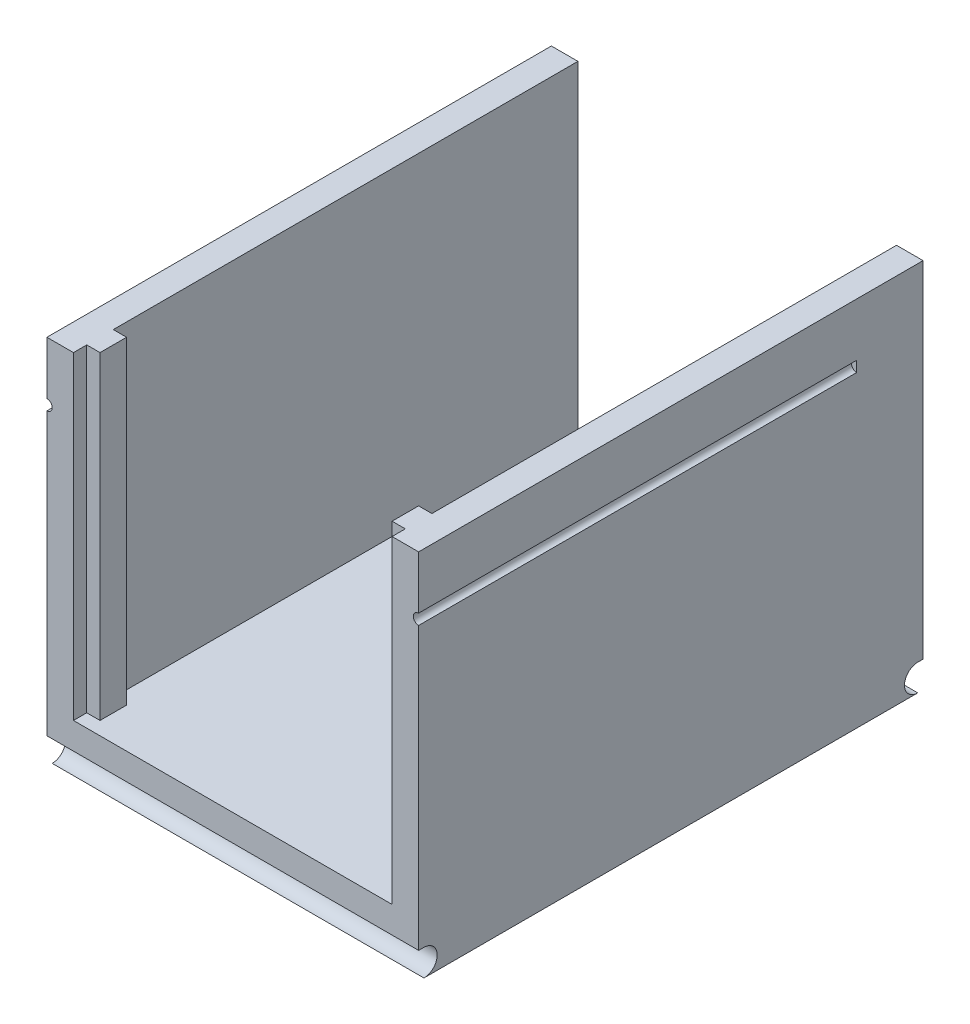
ISO-10303-21;
HEADER;
FILE_DESCRIPTION(('STEP AP214'),'2;1');
FILE_NAME('part.step','',(''),(''),'','','');
FILE_SCHEMA(('AUTOMOTIVE_DESIGN { 1 0 10303 214 1 1 1 1 }'));
ENDSEC;
DATA;
#1=APPLICATION_CONTEXT('core data for automotive mechanical design processes');
#2=APPLICATION_PROTOCOL_DEFINITION('international standard','automotive_design',2000,#1);
#3=PRODUCT_CONTEXT('',#1,'mechanical');
#4=PRODUCT('Part','Part','',(#3));
#5=PRODUCT_RELATED_PRODUCT_CATEGORY('part','',(#4));
#6=PRODUCT_DEFINITION_FORMATION('','',#4);
#7=PRODUCT_DEFINITION_CONTEXT('part definition',#1,'design');
#8=PRODUCT_DEFINITION('design','',#6,#7);
#9=PRODUCT_DEFINITION_SHAPE('','',#8);
#10=(LENGTH_UNIT() NAMED_UNIT(*) SI_UNIT(.MILLI.,.METRE.));
#11=(NAMED_UNIT(*) PLANE_ANGLE_UNIT() SI_UNIT($,.RADIAN.));
#12=(NAMED_UNIT(*) SI_UNIT($,.STERADIAN.) SOLID_ANGLE_UNIT());
#13=UNCERTAINTY_MEASURE_WITH_UNIT(LENGTH_MEASURE(1.E-05),#10,'distance_accuracy_value','');
#14=(GEOMETRIC_REPRESENTATION_CONTEXT(3) GLOBAL_UNCERTAINTY_ASSIGNED_CONTEXT((#13)) GLOBAL_UNIT_ASSIGNED_CONTEXT((#10,
#11,#12)) REPRESENTATION_CONTEXT('',''));
#15=CARTESIAN_POINT('',(0.,0.,0.));
#16=DIRECTION('',(0.,0.,1.));
#17=DIRECTION('',(1.,0.,0.));
#18=AXIS2_PLACEMENT_3D('',#15,#16,#17);
#19=CARTESIAN_POINT('',(-70.,70.,-190.));
#20=DIRECTION('',(-1.,0.,0.));
#21=DIRECTION('',(0.,-1.,0.));
#22=AXIS2_PLACEMENT_3D('',#19,#20,#21);
#23=PLANE('',#22);
#24=DIRECTION('',(0.,-1.,0.));
#25=VECTOR('',#24,1.);
#26=CARTESIAN_POINT('',(-70.,70.,0.));
#27=LINE('',#26,#25);
#28=CARTESIAN_POINT('',(-70.,46.,0.));
#29=VERTEX_POINT('',#28);
#30=CARTESIAN_POINT('',(-70.,-60.,0.));
#31=VERTEX_POINT('',#30);
#32=EDGE_CURVE('E354',#29,#31,#27,.T.);
#33=ORIENTED_EDGE('',*,*,#32,.F.);
#34=DIRECTION('',(0.,0.,1.));
#35=VECTOR('',#34,1.);
#36=CARTESIAN_POINT('',(-70.,46.,-165.));
#37=LINE('',#36,#35);
#38=CARTESIAN_POINT('',(-70.,46.,-165.));
#39=VERTEX_POINT('',#38);
#40=EDGE_CURVE('E42',#39,#29,#37,.T.);
#41=ORIENTED_EDGE('',*,*,#40,.F.);
#42=DIRECTION('',(0.,-1.,0.));
#43=VECTOR('',#42,1.);
#44=CARTESIAN_POINT('',(-70.,0.,-165.));
#45=LINE('',#44,#43);
#46=CARTESIAN_POINT('',(-70.,50.,-165.));
#47=VERTEX_POINT('',#46);
#48=EDGE_CURVE('E189',#47,#39,#45,.T.);
#49=ORIENTED_EDGE('',*,*,#48,.F.);
#50=DIRECTION('',(0.,0.,1.));
#51=VECTOR('',#50,1.);
#52=CARTESIAN_POINT('',(-70.,50.,-165.));
#53=LINE('',#52,#51);
#54=CARTESIAN_POINT('',(-70.,50.,0.));
#55=VERTEX_POINT('',#54);
#56=EDGE_CURVE('E179',#47,#55,#53,.T.);
#57=ORIENTED_EDGE('',*,*,#56,.T.);
#58=CARTESIAN_POINT('',(-70.,70.,0.));
#59=VERTEX_POINT('',#58);
#60=EDGE_CURVE('E340',#59,#55,#27,.T.);
#61=ORIENTED_EDGE('',*,*,#60,.F.);
#62=DIRECTION('',(0.,0.,1.));
#63=VECTOR('',#62,1.);
#64=CARTESIAN_POINT('',(-70.,70.,-190.));
#65=LINE('',#64,#63);
#66=CARTESIAN_POINT('',(-70.,70.,-190.));
#67=VERTEX_POINT('',#66);
#68=EDGE_CURVE('E357',#67,#59,#65,.T.);
#69=ORIENTED_EDGE('',*,*,#68,.F.);
#70=DIRECTION('',(0.,-1.,0.));
#71=VECTOR('',#70,1.);
#72=CARTESIAN_POINT('',(-70.,70.,-190.));
#73=LINE('',#72,#71);
#74=CARTESIAN_POINT('',(-70.,-60.,-190.));
#75=VERTEX_POINT('',#74);
#76=EDGE_CURVE('E344',#67,#75,#73,.T.);
#77=ORIENTED_EDGE('',*,*,#76,.T.);
#78=DIRECTION('',(0.,0.,-1.));
#79=VECTOR('',#78,1.);
#80=CARTESIAN_POINT('',(-70.,-60.,-190.));
#81=LINE('',#80,#79);
#82=CARTESIAN_POINT('',(-70.,-60.,-188.));
#83=VERTEX_POINT('',#82);
#84=EDGE_CURVE('E230',#83,#75,#81,.T.);
#85=ORIENTED_EDGE('',*,*,#84,.F.);
#86=CARTESIAN_POINT('',(-70.,-65.,-188.));
#87=DIRECTION('',(-1.,0.,0.));
#88=DIRECTION('',(0.,-1.,0.));
#89=AXIS2_PLACEMENT_3D('',#86,#87,#88);
#90=CIRCLE('',#89,5.);
#91=CARTESIAN_POINT('',(-70.,-70.,-188.));
#92=VERTEX_POINT('',#91);
#93=EDGE_CURVE('E221',#92,#83,#90,.T.);
#94=ORIENTED_EDGE('',*,*,#93,.F.);
#95=DIRECTION('',(0.,0.,1.));
#96=VECTOR('',#95,1.);
#97=CARTESIAN_POINT('',(-70.,-70.,-190.));
#98=LINE('',#97,#96);
#99=CARTESIAN_POINT('',(-70.,-70.,-2.));
#100=VERTEX_POINT('',#99);
#101=EDGE_CURVE('E26',#92,#100,#98,.T.);
#102=ORIENTED_EDGE('',*,*,#101,.T.);
#103=CARTESIAN_POINT('',(-70.,-65.,-2.));
#104=DIRECTION('',(1.,0.,0.));
#105=DIRECTION('',(0.,-1.,0.));
#106=AXIS2_PLACEMENT_3D('',#103,#104,#105);
#107=CIRCLE('',#106,5.);
#108=CARTESIAN_POINT('',(-70.,-60.,-2.));
#109=VERTEX_POINT('',#108);
#110=EDGE_CURVE('E211',#100,#109,#107,.T.);
#111=ORIENTED_EDGE('',*,*,#110,.T.);
#112=DIRECTION('',(0.,0.,1.));
#113=VECTOR('',#112,1.);
#114=CARTESIAN_POINT('',(-70.,-60.,0.));
#115=LINE('',#114,#113);
#116=EDGE_CURVE('E215',#109,#31,#115,.T.);
#117=ORIENTED_EDGE('',*,*,#116,.T.);
#118=EDGE_LOOP('',(#33,#41,#49,#57,#61,#69,#77,#85,#94,#102,#111,#117));
#119=FACE_BOUND('',#118,.T.);
#120=ADVANCED_FACE('F17',(#119),#23,.T.);
#121=CARTESIAN_POINT('',(0.,0.,0.));
#122=DIRECTION('',(0.,0.,1.));
#123=DIRECTION('',(1.,0.,0.));
#124=AXIS2_PLACEMENT_3D('',#121,#122,#123);
#125=PLANE('',#124);
#126=ORIENTED_EDGE('',*,*,#60,.T.);
#127=CARTESIAN_POINT('',(-70.,48.,0.));
#128=DIRECTION('',(0.,0.,1.));
#129=DIRECTION('',(1.,0.,0.));
#130=AXIS2_PLACEMENT_3D('',#127,#128,#129);
#131=CIRCLE('',#130,2.);
#132=EDGE_CURVE('E184',#55,#29,#131,.F.);
#133=ORIENTED_EDGE('',*,*,#132,.T.);
#134=ORIENTED_EDGE('',*,*,#32,.T.);
#135=DIRECTION('',(-1.,0.,0.));
#136=VECTOR('',#135,1.);
#137=CARTESIAN_POINT('',(82.2065556157337,-60.,0.));
#138=LINE('',#137,#136);
#139=CARTESIAN_POINT('',(70.,-60.,0.));
#140=VERTEX_POINT('',#139);
#141=EDGE_CURVE('E218',#140,#31,#138,.T.);
#142=ORIENTED_EDGE('',*,*,#141,.F.);
#143=DIRECTION('',(0.,1.,0.));
#144=VECTOR('',#143,1.);
#145=CARTESIAN_POINT('',(70.,70.,0.));
#146=LINE('',#145,#144);
#147=CARTESIAN_POINT('',(70.,46.,0.));
#148=VERTEX_POINT('',#147);
#149=EDGE_CURVE('E347',#140,#148,#146,.T.);
#150=ORIENTED_EDGE('',*,*,#149,.T.);
#151=CARTESIAN_POINT('',(70.,48.,0.));
#152=DIRECTION('',(0.,0.,1.));
#153=DIRECTION('',(1.,0.,0.));
#154=AXIS2_PLACEMENT_3D('',#151,#152,#153);
#155=CIRCLE('',#154,2.);
#156=CARTESIAN_POINT('',(70.,50.,0.));
#157=VERTEX_POINT('',#156);
#158=EDGE_CURVE('E204',#157,#148,#155,.T.);
#159=ORIENTED_EDGE('',*,*,#158,.F.);
#160=CARTESIAN_POINT('',(70.,70.,0.));
#161=VERTEX_POINT('',#160);
#162=EDGE_CURVE('E314',#157,#161,#146,.T.);
#163=ORIENTED_EDGE('',*,*,#162,.T.);
#164=DIRECTION('',(-1.,0.,0.));
#165=VECTOR('',#164,1.);
#166=CARTESIAN_POINT('',(-70.,70.,0.));
#167=LINE('',#166,#165);
#168=CARTESIAN_POINT('',(60.,70.,0.));
#169=VERTEX_POINT('',#168);
#170=EDGE_CURVE('E351',#161,#169,#167,.T.);
#171=ORIENTED_EDGE('',*,*,#170,.T.);
#172=DIRECTION('',(0.,1.,0.));
#173=VECTOR('',#172,1.);
#174=CARTESIAN_POINT('',(60.,-50.,0.));
#175=LINE('',#174,#173);
#176=CARTESIAN_POINT('',(60.,-50.,0.));
#177=VERTEX_POINT('',#176);
#178=EDGE_CURVE('E284',#177,#169,#175,.T.);
#179=ORIENTED_EDGE('',*,*,#178,.F.);
#180=DIRECTION('',(1.,0.,0.));
#181=VECTOR('',#180,1.);
#182=CARTESIAN_POINT('',(-60.,-50.,0.));
#183=LINE('',#182,#181);
#184=CARTESIAN_POINT('',(-60.,-50.,0.));
#185=VERTEX_POINT('',#184);
#186=EDGE_CURVE('E248',#185,#177,#183,.T.);
#187=ORIENTED_EDGE('',*,*,#186,.F.);
#188=DIRECTION('',(0.,1.,0.));
#189=VECTOR('',#188,1.);
#190=CARTESIAN_POINT('',(-60.,-50.,0.));
#191=LINE('',#190,#189);
#192=CARTESIAN_POINT('',(-60.,70.,0.));
#193=VERTEX_POINT('',#192);
#194=EDGE_CURVE('E311',#185,#193,#191,.T.);
#195=ORIENTED_EDGE('',*,*,#194,.T.);
#196=EDGE_CURVE('E350',#193,#59,#167,.T.);
#197=ORIENTED_EDGE('',*,*,#196,.T.);
#198=EDGE_LOOP('',(#126,#133,#134,#142,#150,#159,#163,#171,#179,#187,#195,#197));
#199=FACE_BOUND('',#198,.T.);
#200=ADVANCED_FACE('F376',(#199),#125,.T.);
#201=CARTESIAN_POINT('',(70.,70.,-190.));
#202=DIRECTION('',(1.,0.,0.));
#203=DIRECTION('',(0.,1.,0.));
#204=AXIS2_PLACEMENT_3D('',#201,#202,#203);
#205=PLANE('',#204);
#206=DIRECTION('',(0.,0.,1.));
#207=VECTOR('',#206,1.);
#208=CARTESIAN_POINT('',(70.,50.,-165.));
#209=LINE('',#208,#207);
#210=CARTESIAN_POINT('',(70.,50.,-165.));
#211=VERTEX_POINT('',#210);
#212=EDGE_CURVE('E34',#211,#157,#209,.T.);
#213=ORIENTED_EDGE('',*,*,#212,.F.);
#214=DIRECTION('',(0.,1.,0.));
#215=VECTOR('',#214,1.);
#216=CARTESIAN_POINT('',(70.,0.,-165.));
#217=LINE('',#216,#215);
#218=CARTESIAN_POINT('',(70.,46.,-165.));
#219=VERTEX_POINT('',#218);
#220=EDGE_CURVE('E201',#219,#211,#217,.T.);
#221=ORIENTED_EDGE('',*,*,#220,.F.);
#222=DIRECTION('',(0.,0.,1.));
#223=VECTOR('',#222,1.);
#224=CARTESIAN_POINT('',(70.,46.,-165.));
#225=LINE('',#224,#223);
#226=EDGE_CURVE('E198',#219,#148,#225,.T.);
#227=ORIENTED_EDGE('',*,*,#226,.T.);
#228=ORIENTED_EDGE('',*,*,#149,.F.);
#229=DIRECTION('',(0.,0.,1.));
#230=VECTOR('',#229,1.);
#231=CARTESIAN_POINT('',(70.,-60.,0.));
#232=LINE('',#231,#230);
#233=CARTESIAN_POINT('',(70.,-60.,-2.));
#234=VERTEX_POINT('',#233);
#235=EDGE_CURVE('E219',#234,#140,#232,.T.);
#236=ORIENTED_EDGE('',*,*,#235,.F.);
#237=CARTESIAN_POINT('',(70.,-65.,-2.));
#238=DIRECTION('',(1.,0.,0.));
#239=DIRECTION('',(0.,1.,0.));
#240=AXIS2_PLACEMENT_3D('',#237,#238,#239);
#241=CIRCLE('',#240,5.);
#242=CARTESIAN_POINT('',(70.,-70.,-2.));
#243=VERTEX_POINT('',#242);
#244=EDGE_CURVE('E222',#243,#234,#241,.T.);
#245=ORIENTED_EDGE('',*,*,#244,.F.);
#246=DIRECTION('',(0.,0.,1.));
#247=VECTOR('',#246,1.);
#248=CARTESIAN_POINT('',(70.,-70.,-190.));
#249=LINE('',#248,#247);
#250=CARTESIAN_POINT('',(70.,-70.,-188.));
#251=VERTEX_POINT('',#250);
#252=EDGE_CURVE('E11',#251,#243,#249,.T.);
#253=ORIENTED_EDGE('',*,*,#252,.F.);
#254=CARTESIAN_POINT('',(70.,-65.,-188.));
#255=DIRECTION('',(1.,0.,0.));
#256=DIRECTION('',(0.,1.,0.));
#257=AXIS2_PLACEMENT_3D('',#254,#255,#256);
#258=CIRCLE('',#257,5.);
#259=CARTESIAN_POINT('',(70.,-60.,-188.));
#260=VERTEX_POINT('',#259);
#261=EDGE_CURVE('E232',#251,#260,#258,.F.);
#262=ORIENTED_EDGE('',*,*,#261,.T.);
#263=DIRECTION('',(0.,0.,-1.));
#264=VECTOR('',#263,1.);
#265=CARTESIAN_POINT('',(70.,-60.,-190.));
#266=LINE('',#265,#264);
#267=CARTESIAN_POINT('',(70.,-60.,-190.));
#268=VERTEX_POINT('',#267);
#269=EDGE_CURVE('E238',#260,#268,#266,.T.);
#270=ORIENTED_EDGE('',*,*,#269,.T.);
#271=DIRECTION('',(0.,1.,0.));
#272=VECTOR('',#271,1.);
#273=CARTESIAN_POINT('',(70.,70.,-190.));
#274=LINE('',#273,#272);
#275=CARTESIAN_POINT('',(70.,70.,-190.));
#276=VERTEX_POINT('',#275);
#277=EDGE_CURVE('E337',#268,#276,#274,.T.);
#278=ORIENTED_EDGE('',*,*,#277,.T.);
#279=DIRECTION('',(0.,0.,1.));
#280=VECTOR('',#279,1.);
#281=CARTESIAN_POINT('',(70.,70.,-190.));
#282=LINE('',#281,#280);
#283=EDGE_CURVE('E21',#276,#161,#282,.T.);
#284=ORIENTED_EDGE('',*,*,#283,.T.);
#285=ORIENTED_EDGE('',*,*,#162,.F.);
#286=EDGE_LOOP('',(#213,#221,#227,#228,#236,#245,#253,#262,#270,#278,#284,#285));
#287=FACE_BOUND('',#286,.T.);
#288=ADVANCED_FACE('F19',(#287),#205,.T.);
#289=CARTESIAN_POINT('',(-70.,70.,-190.));
#290=DIRECTION('',(0.,1.,0.));
#291=DIRECTION('',(0.,0.,1.));
#292=AXIS2_PLACEMENT_3D('',#289,#290,#291);
#293=PLANE('',#292);
#294=DIRECTION('',(0.,0.,1.));
#295=VECTOR('',#294,1.);
#296=CARTESIAN_POINT('',(-60.,70.,-5.));
#297=LINE('',#296,#295);
#298=CARTESIAN_POINT('',(-60.,70.,-5.));
#299=VERTEX_POINT('',#298);
#300=EDGE_CURVE('E252',#299,#193,#297,.T.);
#301=ORIENTED_EDGE('',*,*,#300,.F.);
#302=DIRECTION('',(-1.,0.,0.));
#303=VECTOR('',#302,1.);
#304=CARTESIAN_POINT('',(-55.,70.,-5.));
#305=LINE('',#304,#303);
#306=CARTESIAN_POINT('',(-55.,70.,-5.));
#307=VERTEX_POINT('',#306);
#308=EDGE_CURVE('E307',#307,#299,#305,.T.);
#309=ORIENTED_EDGE('',*,*,#308,.F.);
#310=DIRECTION('',(0.,0.,1.));
#311=VECTOR('',#310,1.);
#312=CARTESIAN_POINT('',(-55.,70.,-15.));
#313=LINE('',#312,#311);
#314=CARTESIAN_POINT('',(-55.,70.,-15.));
#315=VERTEX_POINT('',#314);
#316=EDGE_CURVE('E304',#315,#307,#313,.T.);
#317=ORIENTED_EDGE('',*,*,#316,.F.);
#318=DIRECTION('',(1.,0.,0.));
#319=VECTOR('',#318,1.);
#320=CARTESIAN_POINT('',(-60.,70.,-15.));
#321=LINE('',#320,#319);
#322=CARTESIAN_POINT('',(-60.,70.,-15.));
#323=VERTEX_POINT('',#322);
#324=EDGE_CURVE('E301',#323,#315,#321,.T.);
#325=ORIENTED_EDGE('',*,*,#324,.F.);
#326=DIRECTION('',(0.,0.,1.));
#327=VECTOR('',#326,1.);
#328=CARTESIAN_POINT('',(-60.,70.,-190.));
#329=LINE('',#328,#327);
#330=CARTESIAN_POINT('',(-60.,70.,-190.));
#331=VERTEX_POINT('',#330);
#332=EDGE_CURVE('E298',#331,#323,#329,.T.);
#333=ORIENTED_EDGE('',*,*,#332,.F.);
#334=DIRECTION('',(-1.,0.,0.));
#335=VECTOR('',#334,1.);
#336=CARTESIAN_POINT('',(-70.,70.,-190.));
#337=LINE('',#336,#335);
#338=EDGE_CURVE('E339',#331,#67,#337,.T.);
#339=ORIENTED_EDGE('',*,*,#338,.T.);
#340=ORIENTED_EDGE('',*,*,#68,.T.);
#341=ORIENTED_EDGE('',*,*,#196,.F.);
#342=EDGE_LOOP('',(#301,#309,#317,#325,#333,#339,#340,#341));
#343=FACE_BOUND('',#342,.T.);
#344=ADVANCED_FACE('F407',(#343),#293,.T.);
#345=CARTESIAN_POINT('',(-70.,-70.,-190.));
#346=DIRECTION('',(0.,-1.,0.));
#347=DIRECTION('',(0.,0.,-1.));
#348=AXIS2_PLACEMENT_3D('',#345,#346,#347);
#349=PLANE('',#348);
#350=DIRECTION('',(-1.,0.,0.));
#351=VECTOR('',#350,1.);
#352=CARTESIAN_POINT('',(82.2065556157337,-70.,-2.));
#353=LINE('',#352,#351);
#354=EDGE_CURVE('E199',#243,#100,#353,.T.);
#355=ORIENTED_EDGE('',*,*,#354,.T.);
#356=ORIENTED_EDGE('',*,*,#101,.F.);
#357=DIRECTION('',(-1.,0.,0.));
#358=VECTOR('',#357,1.);
#359=CARTESIAN_POINT('',(82.2065556157337,-70.,-188.));
#360=LINE('',#359,#358);
#361=EDGE_CURVE('E244',#251,#92,#360,.T.);
#362=ORIENTED_EDGE('',*,*,#361,.F.);
#363=ORIENTED_EDGE('',*,*,#252,.T.);
#364=EDGE_LOOP('',(#355,#356,#362,#363));
#365=FACE_BOUND('',#364,.T.);
#366=ADVANCED_FACE('F404',(#365),#349,.T.);
#367=DIRECTION('',(0.,0.,-1.));
#368=VECTOR('',#367,1.);
#369=CARTESIAN_POINT('',(60.,70.,-15.));
#370=LINE('',#369,#368);
#371=CARTESIAN_POINT('',(60.,70.,-15.));
#372=VERTEX_POINT('',#371);
#373=CARTESIAN_POINT('',(60.,70.,-190.));
#374=VERTEX_POINT('',#373);
#375=EDGE_CURVE('E296',#372,#374,#370,.T.);
#376=ORIENTED_EDGE('',*,*,#375,.F.);
#377=DIRECTION('',(1.,0.,0.));
#378=VECTOR('',#377,1.);
#379=CARTESIAN_POINT('',(55.,70.,-15.));
#380=LINE('',#379,#378);
#381=CARTESIAN_POINT('',(55.,70.,-15.));
#382=VERTEX_POINT('',#381);
#383=EDGE_CURVE('E293',#382,#372,#380,.T.);
#384=ORIENTED_EDGE('',*,*,#383,.F.);
#385=DIRECTION('',(0.,0.,-1.));
#386=VECTOR('',#385,1.);
#387=CARTESIAN_POINT('',(55.,70.,-5.));
#388=LINE('',#387,#386);
#389=CARTESIAN_POINT('',(55.,70.,-5.));
#390=VERTEX_POINT('',#389);
#391=EDGE_CURVE('E290',#390,#382,#388,.T.);
#392=ORIENTED_EDGE('',*,*,#391,.F.);
#393=DIRECTION('',(-1.,0.,0.));
#394=VECTOR('',#393,1.);
#395=CARTESIAN_POINT('',(60.,70.,-5.));
#396=LINE('',#395,#394);
#397=CARTESIAN_POINT('',(60.,70.,-5.));
#398=VERTEX_POINT('',#397);
#399=EDGE_CURVE('E287',#398,#390,#396,.T.);
#400=ORIENTED_EDGE('',*,*,#399,.F.);
#401=DIRECTION('',(0.,0.,-1.));
#402=VECTOR('',#401,1.);
#403=CARTESIAN_POINT('',(60.,70.,0.));
#404=LINE('',#403,#402);
#405=EDGE_CURVE('E247',#169,#398,#404,.T.);
#406=ORIENTED_EDGE('',*,*,#405,.F.);
#407=ORIENTED_EDGE('',*,*,#170,.F.);
#408=ORIENTED_EDGE('',*,*,#283,.F.);
#409=EDGE_CURVE('E341',#276,#374,#337,.T.);
#410=ORIENTED_EDGE('',*,*,#409,.T.);
#411=EDGE_LOOP('',(#376,#384,#392,#400,#406,#407,#408,#410));
#412=FACE_BOUND('',#411,.T.);
#413=ADVANCED_FACE('F372',(#412),#293,.T.);
#414=CARTESIAN_POINT('',(0.,0.,-190.));
#415=DIRECTION('',(0.,0.,1.));
#416=DIRECTION('',(1.,0.,0.));
#417=AXIS2_PLACEMENT_3D('',#414,#415,#416);
#418=PLANE('',#417);
#419=ORIENTED_EDGE('',*,*,#277,.F.);
#420=DIRECTION('',(-1.,0.,0.));
#421=VECTOR('',#420,1.);
#422=CARTESIAN_POINT('',(82.2065556157337,-60.,-190.));
#423=LINE('',#422,#421);
#424=EDGE_CURVE('E241',#268,#75,#423,.T.);
#425=ORIENTED_EDGE('',*,*,#424,.T.);
#426=ORIENTED_EDGE('',*,*,#76,.F.);
#427=ORIENTED_EDGE('',*,*,#338,.F.);
#428=DIRECTION('',(0.,1.,0.));
#429=VECTOR('',#428,1.);
#430=CARTESIAN_POINT('',(-60.,-50.,-190.));
#431=LINE('',#430,#429);
#432=CARTESIAN_POINT('',(-60.,-50.,-190.));
#433=VERTEX_POINT('',#432);
#434=EDGE_CURVE('E323',#433,#331,#431,.T.);
#435=ORIENTED_EDGE('',*,*,#434,.F.);
#436=DIRECTION('',(-1.,0.,0.));
#437=VECTOR('',#436,1.);
#438=CARTESIAN_POINT('',(60.,-50.,-190.));
#439=LINE('',#438,#437);
#440=CARTESIAN_POINT('',(60.,-50.,-190.));
#441=VERTEX_POINT('',#440);
#442=EDGE_CURVE('E267',#441,#433,#439,.T.);
#443=ORIENTED_EDGE('',*,*,#442,.F.);
#444=DIRECTION('',(0.,1.,0.));
#445=VECTOR('',#444,1.);
#446=CARTESIAN_POINT('',(60.,-50.,-190.));
#447=LINE('',#446,#445);
#448=EDGE_CURVE('E325',#441,#374,#447,.T.);
#449=ORIENTED_EDGE('',*,*,#448,.T.);
#450=ORIENTED_EDGE('',*,*,#409,.F.);
#451=EDGE_LOOP('',(#419,#425,#426,#427,#435,#443,#449,#450));
#452=FACE_BOUND('',#451,.T.);
#453=ADVANCED_FACE('F406',(#452),#418,.F.);
#454=CARTESIAN_POINT('',(-60.,-50.,-5.));
#455=DIRECTION('',(-1.,0.,0.));
#456=DIRECTION('',(0.,0.,1.));
#457=AXIS2_PLACEMENT_3D('',#454,#455,#456);
#458=PLANE('',#457);
#459=ORIENTED_EDGE('',*,*,#300,.T.);
#460=ORIENTED_EDGE('',*,*,#194,.F.);
#461=DIRECTION('',(0.,0.,1.));
#462=VECTOR('',#461,1.);
#463=CARTESIAN_POINT('',(-60.,-50.,-5.));
#464=LINE('',#463,#462);
#465=CARTESIAN_POINT('',(-60.,-50.,-5.));
#466=VERTEX_POINT('',#465);
#467=EDGE_CURVE('E282',#466,#185,#464,.T.);
#468=ORIENTED_EDGE('',*,*,#467,.F.);
#469=DIRECTION('',(0.,1.,0.));
#470=VECTOR('',#469,1.);
#471=CARTESIAN_POINT('',(-60.,-50.,-5.));
#472=LINE('',#471,#470);
#473=EDGE_CURVE('E315',#466,#299,#472,.T.);
#474=ORIENTED_EDGE('',*,*,#473,.T.);
#475=EDGE_LOOP('',(#459,#460,#468,#474));
#476=FACE_BOUND('',#475,.T.);
#477=ADVANCED_FACE('F413',(#476),#458,.F.);
#478=CARTESIAN_POINT('',(-55.,-50.,-5.));
#479=DIRECTION('',(0.,0.,-1.));
#480=DIRECTION('',(-1.,0.,0.));
#481=AXIS2_PLACEMENT_3D('',#478,#479,#480);
#482=PLANE('',#481);
#483=ORIENTED_EDGE('',*,*,#308,.T.);
#484=ORIENTED_EDGE('',*,*,#473,.F.);
#485=DIRECTION('',(-1.,0.,0.));
#486=VECTOR('',#485,1.);
#487=CARTESIAN_POINT('',(-55.,-50.,-5.));
#488=LINE('',#487,#486);
#489=CARTESIAN_POINT('',(-55.,-50.,-5.));
#490=VERTEX_POINT('',#489);
#491=EDGE_CURVE('E279',#490,#466,#488,.T.);
#492=ORIENTED_EDGE('',*,*,#491,.F.);
#493=DIRECTION('',(0.,1.,0.));
#494=VECTOR('',#493,1.);
#495=CARTESIAN_POINT('',(-55.,-50.,-5.));
#496=LINE('',#495,#494);
#497=EDGE_CURVE('E317',#490,#307,#496,.T.);
#498=ORIENTED_EDGE('',*,*,#497,.T.);
#499=EDGE_LOOP('',(#483,#484,#492,#498));
#500=FACE_BOUND('',#499,.T.);
#501=ADVANCED_FACE('F433',(#500),#482,.F.);
#502=CARTESIAN_POINT('',(-55.,-50.,-15.));
#503=DIRECTION('',(-1.,0.,0.));
#504=DIRECTION('',(0.,0.,1.));
#505=AXIS2_PLACEMENT_3D('',#502,#503,#504);
#506=PLANE('',#505);
#507=ORIENTED_EDGE('',*,*,#316,.T.);
#508=ORIENTED_EDGE('',*,*,#497,.F.);
#509=DIRECTION('',(0.,0.,1.));
#510=VECTOR('',#509,1.);
#511=CARTESIAN_POINT('',(-55.,-50.,-15.));
#512=LINE('',#511,#510);
#513=CARTESIAN_POINT('',(-55.,-50.,-15.));
#514=VERTEX_POINT('',#513);
#515=EDGE_CURVE('E276',#514,#490,#512,.T.);
#516=ORIENTED_EDGE('',*,*,#515,.F.);
#517=DIRECTION('',(0.,1.,0.));
#518=VECTOR('',#517,1.);
#519=CARTESIAN_POINT('',(-55.,-50.,-15.));
#520=LINE('',#519,#518);
#521=EDGE_CURVE('E319',#514,#315,#520,.T.);
#522=ORIENTED_EDGE('',*,*,#521,.T.);
#523=EDGE_LOOP('',(#507,#508,#516,#522));
#524=FACE_BOUND('',#523,.T.);
#525=ADVANCED_FACE('F435',(#524),#506,.F.);
#526=CARTESIAN_POINT('',(-60.,-50.,-15.));
#527=DIRECTION('',(0.,0.,1.));
#528=DIRECTION('',(1.,0.,0.));
#529=AXIS2_PLACEMENT_3D('',#526,#527,#528);
#530=PLANE('',#529);
#531=ORIENTED_EDGE('',*,*,#324,.T.);
#532=ORIENTED_EDGE('',*,*,#521,.F.);
#533=DIRECTION('',(1.,0.,0.));
#534=VECTOR('',#533,1.);
#535=CARTESIAN_POINT('',(-60.,-50.,-15.));
#536=LINE('',#535,#534);
#537=CARTESIAN_POINT('',(-60.,-50.,-15.));
#538=VERTEX_POINT('',#537);
#539=EDGE_CURVE('E273',#538,#514,#536,.T.);
#540=ORIENTED_EDGE('',*,*,#539,.F.);
#541=DIRECTION('',(0.,1.,0.));
#542=VECTOR('',#541,1.);
#543=CARTESIAN_POINT('',(-60.,-50.,-15.));
#544=LINE('',#543,#542);
#545=EDGE_CURVE('E321',#538,#323,#544,.T.);
#546=ORIENTED_EDGE('',*,*,#545,.T.);
#547=EDGE_LOOP('',(#531,#532,#540,#546));
#548=FACE_BOUND('',#547,.T.);
#549=ADVANCED_FACE('F440',(#548),#530,.F.);
#550=CARTESIAN_POINT('',(-60.,-50.,-190.));
#551=DIRECTION('',(-1.,0.,0.));
#552=DIRECTION('',(0.,0.,1.));
#553=AXIS2_PLACEMENT_3D('',#550,#551,#552);
#554=PLANE('',#553);
#555=ORIENTED_EDGE('',*,*,#332,.T.);
#556=ORIENTED_EDGE('',*,*,#545,.F.);
#557=DIRECTION('',(0.,0.,1.));
#558=VECTOR('',#557,1.);
#559=CARTESIAN_POINT('',(-60.,-50.,-190.));
#560=LINE('',#559,#558);
#561=EDGE_CURVE('E270',#433,#538,#560,.T.);
#562=ORIENTED_EDGE('',*,*,#561,.F.);
#563=ORIENTED_EDGE('',*,*,#434,.T.);
#564=EDGE_LOOP('',(#555,#556,#562,#563));
#565=FACE_BOUND('',#564,.T.);
#566=ADVANCED_FACE('F443',(#565),#554,.F.);
#567=CARTESIAN_POINT('',(60.,-50.,-15.));
#568=DIRECTION('',(1.,0.,0.));
#569=DIRECTION('',(0.,0.,-1.));
#570=AXIS2_PLACEMENT_3D('',#567,#568,#569);
#571=PLANE('',#570);
#572=ORIENTED_EDGE('',*,*,#375,.T.);
#573=ORIENTED_EDGE('',*,*,#448,.F.);
#574=DIRECTION('',(0.,0.,-1.));
#575=VECTOR('',#574,1.);
#576=CARTESIAN_POINT('',(60.,-50.,-15.));
#577=LINE('',#576,#575);
#578=CARTESIAN_POINT('',(60.,-50.,-15.));
#579=VERTEX_POINT('',#578);
#580=EDGE_CURVE('E264',#579,#441,#577,.T.);
#581=ORIENTED_EDGE('',*,*,#580,.F.);
#582=DIRECTION('',(0.,1.,0.));
#583=VECTOR('',#582,1.);
#584=CARTESIAN_POINT('',(60.,-50.,-15.));
#585=LINE('',#584,#583);
#586=EDGE_CURVE('E328',#579,#372,#585,.T.);
#587=ORIENTED_EDGE('',*,*,#586,.T.);
#588=EDGE_LOOP('',(#572,#573,#581,#587));
#589=FACE_BOUND('',#588,.T.);
#590=ADVANCED_FACE('F464',(#589),#571,.F.);
#591=CARTESIAN_POINT('',(55.,-50.,-15.));
#592=DIRECTION('',(0.,0.,1.));
#593=DIRECTION('',(1.,0.,0.));
#594=AXIS2_PLACEMENT_3D('',#591,#592,#593);
#595=PLANE('',#594);
#596=ORIENTED_EDGE('',*,*,#383,.T.);
#597=ORIENTED_EDGE('',*,*,#586,.F.);
#598=DIRECTION('',(1.,0.,0.));
#599=VECTOR('',#598,1.);
#600=CARTESIAN_POINT('',(55.,-50.,-15.));
#601=LINE('',#600,#599);
#602=CARTESIAN_POINT('',(55.,-50.,-15.));
#603=VERTEX_POINT('',#602);
#604=EDGE_CURVE('E261',#603,#579,#601,.T.);
#605=ORIENTED_EDGE('',*,*,#604,.F.);
#606=DIRECTION('',(0.,1.,0.));
#607=VECTOR('',#606,1.);
#608=CARTESIAN_POINT('',(55.,-50.,-15.));
#609=LINE('',#608,#607);
#610=EDGE_CURVE('E330',#603,#382,#609,.T.);
#611=ORIENTED_EDGE('',*,*,#610,.T.);
#612=EDGE_LOOP('',(#596,#597,#605,#611));
#613=FACE_BOUND('',#612,.T.);
#614=ADVANCED_FACE('F468',(#613),#595,.F.);
#615=CARTESIAN_POINT('',(55.,-50.,-5.));
#616=DIRECTION('',(1.,0.,0.));
#617=DIRECTION('',(0.,0.,-1.));
#618=AXIS2_PLACEMENT_3D('',#615,#616,#617);
#619=PLANE('',#618);
#620=ORIENTED_EDGE('',*,*,#391,.T.);
#621=ORIENTED_EDGE('',*,*,#610,.F.);
#622=DIRECTION('',(0.,0.,-1.));
#623=VECTOR('',#622,1.);
#624=CARTESIAN_POINT('',(55.,-50.,-5.));
#625=LINE('',#624,#623);
#626=CARTESIAN_POINT('',(55.,-50.,-5.));
#627=VERTEX_POINT('',#626);
#628=EDGE_CURVE('E258',#627,#603,#625,.T.);
#629=ORIENTED_EDGE('',*,*,#628,.F.);
#630=DIRECTION('',(0.,1.,0.));
#631=VECTOR('',#630,1.);
#632=CARTESIAN_POINT('',(55.,-50.,-5.));
#633=LINE('',#632,#631);
#634=EDGE_CURVE('E332',#627,#390,#633,.T.);
#635=ORIENTED_EDGE('',*,*,#634,.T.);
#636=EDGE_LOOP('',(#620,#621,#629,#635));
#637=FACE_BOUND('',#636,.T.);
#638=ADVANCED_FACE('F471',(#637),#619,.F.);
#639=CARTESIAN_POINT('',(60.,-50.,-5.));
#640=DIRECTION('',(0.,0.,-1.));
#641=DIRECTION('',(-1.,0.,0.));
#642=AXIS2_PLACEMENT_3D('',#639,#640,#641);
#643=PLANE('',#642);
#644=ORIENTED_EDGE('',*,*,#399,.T.);
#645=ORIENTED_EDGE('',*,*,#634,.F.);
#646=DIRECTION('',(-1.,0.,0.));
#647=VECTOR('',#646,1.);
#648=CARTESIAN_POINT('',(60.,-50.,-5.));
#649=LINE('',#648,#647);
#650=CARTESIAN_POINT('',(60.,-50.,-5.));
#651=VERTEX_POINT('',#650);
#652=EDGE_CURVE('E255',#651,#627,#649,.T.);
#653=ORIENTED_EDGE('',*,*,#652,.F.);
#654=DIRECTION('',(0.,1.,0.));
#655=VECTOR('',#654,1.);
#656=CARTESIAN_POINT('',(60.,-50.,-5.));
#657=LINE('',#656,#655);
#658=EDGE_CURVE('E334',#651,#398,#657,.T.);
#659=ORIENTED_EDGE('',*,*,#658,.T.);
#660=EDGE_LOOP('',(#644,#645,#653,#659));
#661=FACE_BOUND('',#660,.T.);
#662=ADVANCED_FACE('F473',(#661),#643,.F.);
#663=CARTESIAN_POINT('',(60.,-50.,0.));
#664=DIRECTION('',(1.,0.,0.));
#665=DIRECTION('',(0.,0.,-1.));
#666=AXIS2_PLACEMENT_3D('',#663,#664,#665);
#667=PLANE('',#666);
#668=ORIENTED_EDGE('',*,*,#405,.T.);
#669=ORIENTED_EDGE('',*,*,#658,.F.);
#670=DIRECTION('',(0.,0.,-1.));
#671=VECTOR('',#670,1.);
#672=CARTESIAN_POINT('',(60.,-50.,0.));
#673=LINE('',#672,#671);
#674=EDGE_CURVE('E251',#177,#651,#673,.T.);
#675=ORIENTED_EDGE('',*,*,#674,.F.);
#676=ORIENTED_EDGE('',*,*,#178,.T.);
#677=EDGE_LOOP('',(#668,#669,#675,#676));
#678=FACE_BOUND('',#677,.T.);
#679=ADVANCED_FACE('F476',(#678),#667,.F.);
#680=CARTESIAN_POINT('',(0.,-50.,0.));
#681=DIRECTION('',(0.,1.,0.));
#682=DIRECTION('',(0.,0.,1.));
#683=AXIS2_PLACEMENT_3D('',#680,#681,#682);
#684=PLANE('',#683);
#685=ORIENTED_EDGE('',*,*,#186,.T.);
#686=ORIENTED_EDGE('',*,*,#674,.T.);
#687=ORIENTED_EDGE('',*,*,#652,.T.);
#688=ORIENTED_EDGE('',*,*,#628,.T.);
#689=ORIENTED_EDGE('',*,*,#604,.T.);
#690=ORIENTED_EDGE('',*,*,#580,.T.);
#691=ORIENTED_EDGE('',*,*,#442,.T.);
#692=ORIENTED_EDGE('',*,*,#561,.T.);
#693=ORIENTED_EDGE('',*,*,#539,.T.);
#694=ORIENTED_EDGE('',*,*,#515,.T.);
#695=ORIENTED_EDGE('',*,*,#491,.T.);
#696=ORIENTED_EDGE('',*,*,#467,.T.);
#697=EDGE_LOOP('',(#685,#686,#687,#688,#689,#690,#691,#692,#693,#694,#695,#696));
#698=FACE_BOUND('',#697,.T.);
#699=ADVANCED_FACE('F429',(#698),#684,.T.);
#700=CARTESIAN_POINT('',(82.2065556157337,-65.,-188.));
#701=DIRECTION('',(-1.,0.,0.));
#702=DIRECTION('',(0.,-1.,0.));
#703=AXIS2_PLACEMENT_3D('',#700,#701,#702);
#704=CYLINDRICAL_SURFACE('',#703,5.);
#705=ORIENTED_EDGE('',*,*,#361,.T.);
#706=ORIENTED_EDGE('',*,*,#93,.T.);
#707=DIRECTION('',(-1.,0.,0.));
#708=VECTOR('',#707,1.);
#709=CARTESIAN_POINT('',(82.2065556157337,-60.,-188.));
#710=LINE('',#709,#708);
#711=EDGE_CURVE('E237',#260,#83,#710,.T.);
#712=ORIENTED_EDGE('',*,*,#711,.F.);
#713=ORIENTED_EDGE('',*,*,#261,.F.);
#714=EDGE_LOOP('',(#705,#706,#712,#713));
#715=FACE_BOUND('',#714,.T.);
#716=ADVANCED_FACE('F457',(#715),#704,.F.);
#717=CARTESIAN_POINT('',(82.2065556157337,-60.,-190.));
#718=DIRECTION('',(0.,1.,0.));
#719=DIRECTION('',(-1.,0.,0.));
#720=AXIS2_PLACEMENT_3D('',#717,#718,#719);
#721=PLANE('',#720);
#722=ORIENTED_EDGE('',*,*,#711,.T.);
#723=ORIENTED_EDGE('',*,*,#84,.T.);
#724=ORIENTED_EDGE('',*,*,#424,.F.);
#725=ORIENTED_EDGE('',*,*,#269,.F.);
#726=EDGE_LOOP('',(#722,#723,#724,#725));
#727=FACE_BOUND('',#726,.T.);
#728=ADVANCED_FACE('F460',(#727),#721,.F.);
#729=CARTESIAN_POINT('',(82.2065556157337,-65.,-2.));
#730=DIRECTION('',(-1.,0.,0.));
#731=DIRECTION('',(0.,-1.,0.));
#732=AXIS2_PLACEMENT_3D('',#729,#730,#731);
#733=CYLINDRICAL_SURFACE('',#732,5.);
#734=ORIENTED_EDGE('',*,*,#244,.T.);
#735=DIRECTION('',(-1.,0.,0.));
#736=VECTOR('',#735,1.);
#737=CARTESIAN_POINT('',(82.2065556157337,-60.,-2.));
#738=LINE('',#737,#736);
#739=EDGE_CURVE('E214',#234,#109,#738,.T.);
#740=ORIENTED_EDGE('',*,*,#739,.T.);
#741=ORIENTED_EDGE('',*,*,#110,.F.);
#742=ORIENTED_EDGE('',*,*,#354,.F.);
#743=EDGE_LOOP('',(#734,#740,#741,#742));
#744=FACE_BOUND('',#743,.T.);
#745=ADVANCED_FACE('F507',(#744),#733,.F.);
#746=CARTESIAN_POINT('',(82.2065556157337,-60.,0.));
#747=DIRECTION('',(0.,-1.,0.));
#748=DIRECTION('',(1.,0.,0.));
#749=AXIS2_PLACEMENT_3D('',#746,#747,#748);
#750=PLANE('',#749);
#751=ORIENTED_EDGE('',*,*,#235,.T.);
#752=ORIENTED_EDGE('',*,*,#141,.T.);
#753=ORIENTED_EDGE('',*,*,#116,.F.);
#754=ORIENTED_EDGE('',*,*,#739,.F.);
#755=EDGE_LOOP('',(#751,#752,#753,#754));
#756=FACE_BOUND('',#755,.T.);
#757=ADVANCED_FACE('F394',(#756),#750,.T.);
#758=CARTESIAN_POINT('',(70.,48.,-165.));
#759=DIRECTION('',(0.,0.,1.));
#760=DIRECTION('',(1.,0.,0.));
#761=AXIS2_PLACEMENT_3D('',#758,#759,#760);
#762=CYLINDRICAL_SURFACE('',#761,2.);
#763=ORIENTED_EDGE('',*,*,#158,.T.);
#764=ORIENTED_EDGE('',*,*,#226,.F.);
#765=CARTESIAN_POINT('',(70.,48.,-165.));
#766=DIRECTION('',(0.,0.,1.));
#767=DIRECTION('',(1.,0.,0.));
#768=AXIS2_PLACEMENT_3D('',#765,#766,#767);
#769=CIRCLE('',#768,2.);
#770=EDGE_CURVE('E203',#211,#219,#769,.T.);
#771=ORIENTED_EDGE('',*,*,#770,.F.);
#772=ORIENTED_EDGE('',*,*,#212,.T.);
#773=EDGE_LOOP('',(#763,#764,#771,#772));
#774=FACE_BOUND('',#773,.T.);
#775=ADVANCED_FACE('F380',(#774),#762,.F.);
#776=CARTESIAN_POINT('',(0.,0.,-165.));
#777=DIRECTION('',(0.,0.,1.));
#778=DIRECTION('',(1.,0.,0.));
#779=AXIS2_PLACEMENT_3D('',#776,#777,#778);
#780=PLANE('',#779);
#781=ORIENTED_EDGE('',*,*,#220,.T.);
#782=ORIENTED_EDGE('',*,*,#770,.T.);
#783=EDGE_LOOP('',(#781,#782));
#784=FACE_BOUND('',#783,.T.);
#785=ADVANCED_FACE('F384',(#784),#780,.T.);
#786=CARTESIAN_POINT('',(-70.,48.,-165.));
#787=DIRECTION('',(0.,0.,1.));
#788=DIRECTION('',(1.,0.,0.));
#789=AXIS2_PLACEMENT_3D('',#786,#787,#788);
#790=CYLINDRICAL_SURFACE('',#789,2.);
#791=ORIENTED_EDGE('',*,*,#132,.F.);
#792=ORIENTED_EDGE('',*,*,#56,.F.);
#793=CARTESIAN_POINT('',(-70.,48.,-165.));
#794=DIRECTION('',(0.,0.,1.));
#795=DIRECTION('',(1.,0.,0.));
#796=AXIS2_PLACEMENT_3D('',#793,#794,#795);
#797=CIRCLE('',#796,2.);
#798=EDGE_CURVE('E182',#47,#39,#797,.F.);
#799=ORIENTED_EDGE('',*,*,#798,.T.);
#800=ORIENTED_EDGE('',*,*,#40,.T.);
#801=EDGE_LOOP('',(#791,#792,#799,#800));
#802=FACE_BOUND('',#801,.T.);
#803=ADVANCED_FACE('F181',(#802),#790,.F.);
#804=CARTESIAN_POINT('',(0.,0.,-165.));
#805=DIRECTION('',(0.,0.,1.));
#806=DIRECTION('',(1.,0.,0.));
#807=AXIS2_PLACEMENT_3D('',#804,#805,#806);
#808=PLANE('',#807);
#809=ORIENTED_EDGE('',*,*,#798,.F.);
#810=ORIENTED_EDGE('',*,*,#48,.T.);
#811=EDGE_LOOP('',(#809,#810));
#812=FACE_BOUND('',#811,.T.);
#813=ADVANCED_FACE('F192',(#812),#808,.T.);
#814=CLOSED_SHELL('',(#120,#200,#288,#344,#366,#413,#453,#477,#501,#525,#549,#566,#590,#614,
#638,#662,#679,#699,#716,#728,#745,#757,#775,#785,#803,#813));
#815=MANIFOLD_SOLID_BREP('B1',#814);
#816=ADVANCED_BREP_SHAPE_REPRESENTATION('',(#18,#815),#14);
#817=SHAPE_DEFINITION_REPRESENTATION(#9,#816);
ENDSEC;
END-ISO-10303-21;
